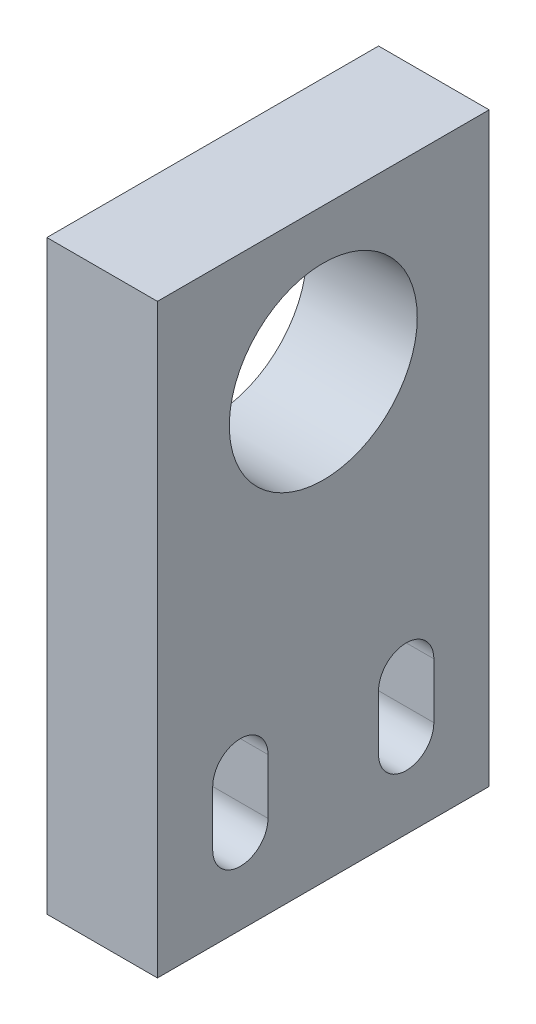
ISO-10303-21;
HEADER;
FILE_DESCRIPTION(('STEP AP214'),'2;1');
FILE_NAME('part.step','',(''),(''),'','','');
FILE_SCHEMA(('AUTOMOTIVE_DESIGN { 1 0 10303 214 1 1 1 1 }'));
ENDSEC;
DATA;
#1=APPLICATION_CONTEXT('core data for automotive mechanical design processes');
#2=APPLICATION_PROTOCOL_DEFINITION('international standard','automotive_design',2000,#1);
#3=PRODUCT_CONTEXT('',#1,'mechanical');
#4=PRODUCT('Part','Part','',(#3));
#5=PRODUCT_RELATED_PRODUCT_CATEGORY('part','',(#4));
#6=PRODUCT_DEFINITION_FORMATION('','',#4);
#7=PRODUCT_DEFINITION_CONTEXT('part definition',#1,'design');
#8=PRODUCT_DEFINITION('design','',#6,#7);
#9=PRODUCT_DEFINITION_SHAPE('','',#8);
#10=(LENGTH_UNIT() NAMED_UNIT(*) SI_UNIT(.MILLI.,.METRE.));
#11=(NAMED_UNIT(*) PLANE_ANGLE_UNIT() SI_UNIT($,.RADIAN.));
#12=(NAMED_UNIT(*) SI_UNIT($,.STERADIAN.) SOLID_ANGLE_UNIT());
#13=UNCERTAINTY_MEASURE_WITH_UNIT(LENGTH_MEASURE(1.E-05),#10,'distance_accuracy_value','');
#14=(GEOMETRIC_REPRESENTATION_CONTEXT(3) GLOBAL_UNCERTAINTY_ASSIGNED_CONTEXT((#13)) GLOBAL_UNIT_ASSIGNED_CONTEXT((#10,
#11,#12)) REPRESENTATION_CONTEXT('',''));
#15=CARTESIAN_POINT('',(0.,0.,0.));
#16=DIRECTION('',(0.,0.,1.));
#17=DIRECTION('',(1.,0.,0.));
#18=AXIS2_PLACEMENT_3D('',#15,#16,#17);
#19=CARTESIAN_POINT('',(10.,0.,0.));
#20=DIRECTION('',(-1.,0.,0.));
#21=DIRECTION('',(0.,0.,1.));
#22=AXIS2_PLACEMENT_3D('',#19,#20,#21);
#23=PLANE('',#22);
#24=CARTESIAN_POINT('',(10.,-27.5,7.49999999999999));
#25=DIRECTION('',(1.,0.,0.));
#26=DIRECTION('',(0.,0.,-1.));
#27=AXIS2_PLACEMENT_3D('',#24,#25,#26);
#28=CIRCLE('',#27,2.50000000000001);
#29=CARTESIAN_POINT('',(10.,-27.5,4.99999999999997));
#30=VERTEX_POINT('',#29);
#31=CARTESIAN_POINT('',(10.,-27.5,9.99999999999999));
#32=VERTEX_POINT('',#31);
#33=EDGE_CURVE('E162',#30,#32,#28,.T.);
#34=ORIENTED_EDGE('',*,*,#33,.F.);
#35=DIRECTION('',(0.,1.,0.));
#36=VECTOR('',#35,1.);
#37=CARTESIAN_POINT('',(10.,-27.5,4.99999999999997));
#38=LINE('',#37,#36);
#39=CARTESIAN_POINT('',(10.,-32.5,4.99999999999997));
#40=VERTEX_POINT('',#39);
#41=EDGE_CURVE('E170',#40,#30,#38,.T.);
#42=ORIENTED_EDGE('',*,*,#41,.F.);
#43=CARTESIAN_POINT('',(10.,-32.5,7.49999999999999));
#44=DIRECTION('',(1.,0.,0.));
#45=DIRECTION('',(0.,0.,-1.));
#46=AXIS2_PLACEMENT_3D('',#43,#44,#45);
#47=CIRCLE('',#46,2.50000000000001);
#48=CARTESIAN_POINT('',(10.,-32.5,10.));
#49=VERTEX_POINT('',#48);
#50=EDGE_CURVE('E167',#49,#40,#47,.T.);
#51=ORIENTED_EDGE('',*,*,#50,.F.);
#52=DIRECTION('',(0.,-1.,0.));
#53=VECTOR('',#52,1.);
#54=CARTESIAN_POINT('',(10.,-27.5,9.99999999999999));
#55=LINE('',#54,#53);
#56=EDGE_CURVE('E164',#32,#49,#55,.T.);
#57=ORIENTED_EDGE('',*,*,#56,.F.);
#58=EDGE_LOOP('',(#34,#42,#51,#57));
#59=FACE_BOUND('',#58,.T.);
#60=DIRECTION('',(0.,-1.,0.));
#61=VECTOR('',#60,1.);
#62=CARTESIAN_POINT('',(10.,-40.,15.));
#63=LINE('',#62,#61);
#64=CARTESIAN_POINT('',(10.,13.,15.));
#65=VERTEX_POINT('',#64);
#66=CARTESIAN_POINT('',(10.,-40.,15.));
#67=VERTEX_POINT('',#66);
#68=EDGE_CURVE('E199',#65,#67,#63,.T.);
#69=ORIENTED_EDGE('',*,*,#68,.T.);
#70=DIRECTION('',(0.,0.,-1.));
#71=VECTOR('',#70,1.);
#72=CARTESIAN_POINT('',(10.,-40.,-15.));
#73=LINE('',#72,#71);
#74=CARTESIAN_POINT('',(10.,-40.,-15.));
#75=VERTEX_POINT('',#74);
#76=EDGE_CURVE('E202',#67,#75,#73,.T.);
#77=ORIENTED_EDGE('',*,*,#76,.T.);
#78=DIRECTION('',(0.,1.,0.));
#79=VECTOR('',#78,1.);
#80=CARTESIAN_POINT('',(10.,13.,-15.));
#81=LINE('',#80,#79);
#82=CARTESIAN_POINT('',(10.,13.,-15.));
#83=VERTEX_POINT('',#82);
#84=EDGE_CURVE('E205',#75,#83,#81,.T.);
#85=ORIENTED_EDGE('',*,*,#84,.T.);
#86=DIRECTION('',(0.,0.,1.));
#87=VECTOR('',#86,1.);
#88=CARTESIAN_POINT('',(10.,13.,15.));
#89=LINE('',#88,#87);
#90=EDGE_CURVE('E207',#83,#65,#89,.T.);
#91=ORIENTED_EDGE('',*,*,#90,.T.);
#92=EDGE_LOOP('',(#69,#77,#85,#91));
#93=FACE_BOUND('',#92,.T.);
#94=CARTESIAN_POINT('',(10.,0.,0.));
#95=DIRECTION('',(1.,0.,0.));
#96=DIRECTION('',(0.,0.,-1.));
#97=AXIS2_PLACEMENT_3D('',#94,#95,#96);
#98=CIRCLE('',#97,8.5);
#99=CARTESIAN_POINT('',(10.,0.,-8.5));
#100=VERTEX_POINT('',#99);
#101=EDGE_CURVE('E193',#100,#100,#98,.T.);
#102=ORIENTED_EDGE('',*,*,#101,.F.);
#103=EDGE_LOOP('',(#102));
#104=FACE_BOUND('',#103,.T.);
#105=CARTESIAN_POINT('',(10.,-27.5,-7.49999999999999));
#106=DIRECTION('',(1.,0.,0.));
#107=DIRECTION('',(0.,0.,1.));
#108=AXIS2_PLACEMENT_3D('',#105,#106,#107);
#109=CIRCLE('',#108,2.50000000000001);
#110=CARTESIAN_POINT('',(10.,-27.5,-10.));
#111=VERTEX_POINT('',#110);
#112=CARTESIAN_POINT('',(10.,-27.5,-4.99999999999998));
#113=VERTEX_POINT('',#112);
#114=EDGE_CURVE('E126',#111,#113,#109,.T.);
#115=ORIENTED_EDGE('',*,*,#114,.F.);
#116=DIRECTION('',(0.,1.,0.));
#117=VECTOR('',#116,1.);
#118=CARTESIAN_POINT('',(10.,-27.5,-10.));
#119=LINE('',#118,#117);
#120=CARTESIAN_POINT('',(10.,-32.5,-10.));
#121=VERTEX_POINT('',#120);
#122=EDGE_CURVE('E148',#121,#111,#119,.T.);
#123=ORIENTED_EDGE('',*,*,#122,.F.);
#124=CARTESIAN_POINT('',(10.,-32.5,-7.49999999999999));
#125=DIRECTION('',(1.,0.,0.));
#126=DIRECTION('',(0.,0.,1.));
#127=AXIS2_PLACEMENT_3D('',#124,#125,#126);
#128=CIRCLE('',#127,2.50000000000001);
#129=CARTESIAN_POINT('',(10.,-32.5,-4.99999999999998));
#130=VERTEX_POINT('',#129);
#131=EDGE_CURVE('E146',#130,#121,#128,.T.);
#132=ORIENTED_EDGE('',*,*,#131,.F.);
#133=DIRECTION('',(0.,-1.,0.));
#134=VECTOR('',#133,1.);
#135=CARTESIAN_POINT('',(10.,-27.5,-4.99999999999998));
#136=LINE('',#135,#134);
#137=EDGE_CURVE('E134',#113,#130,#136,.T.);
#138=ORIENTED_EDGE('',*,*,#137,.F.);
#139=EDGE_LOOP('',(#115,#123,#132,#138));
#140=FACE_BOUND('',#139,.T.);
#141=ADVANCED_FACE('F37',(#59,#93,#104,#140),#23,.F.);
#142=CARTESIAN_POINT('',(0.,0.,0.));
#143=DIRECTION('',(-1.,0.,0.));
#144=DIRECTION('',(0.,0.,1.));
#145=AXIS2_PLACEMENT_3D('',#142,#143,#144);
#146=PLANE('',#145);
#147=DIRECTION('',(0.,-1.,0.));
#148=VECTOR('',#147,1.);
#149=CARTESIAN_POINT('',(0.,-40.,15.));
#150=LINE('',#149,#148);
#151=CARTESIAN_POINT('',(0.,13.,15.));
#152=VERTEX_POINT('',#151);
#153=CARTESIAN_POINT('',(0.,-40.,15.));
#154=VERTEX_POINT('',#153);
#155=EDGE_CURVE('E196',#152,#154,#150,.T.);
#156=ORIENTED_EDGE('',*,*,#155,.F.);
#157=DIRECTION('',(0.,0.,1.));
#158=VECTOR('',#157,1.);
#159=CARTESIAN_POINT('',(0.,13.,15.));
#160=LINE('',#159,#158);
#161=CARTESIAN_POINT('',(0.,13.,-15.));
#162=VERTEX_POINT('',#161);
#163=EDGE_CURVE('E203',#162,#152,#160,.T.);
#164=ORIENTED_EDGE('',*,*,#163,.F.);
#165=DIRECTION('',(0.,1.,0.));
#166=VECTOR('',#165,1.);
#167=CARTESIAN_POINT('',(0.,13.,-15.));
#168=LINE('',#167,#166);
#169=CARTESIAN_POINT('',(0.,-40.,-15.));
#170=VERTEX_POINT('',#169);
#171=EDGE_CURVE('E214',#170,#162,#168,.T.);
#172=ORIENTED_EDGE('',*,*,#171,.F.);
#173=DIRECTION('',(0.,0.,-1.));
#174=VECTOR('',#173,1.);
#175=CARTESIAN_POINT('',(0.,-40.,-15.));
#176=LINE('',#175,#174);
#177=EDGE_CURVE('E212',#154,#170,#176,.T.);
#178=ORIENTED_EDGE('',*,*,#177,.F.);
#179=EDGE_LOOP('',(#156,#164,#172,#178));
#180=FACE_BOUND('',#179,.T.);
#181=CARTESIAN_POINT('',(0.,0.,0.));
#182=DIRECTION('',(1.,0.,0.));
#183=DIRECTION('',(0.,0.,-1.));
#184=AXIS2_PLACEMENT_3D('',#181,#182,#183);
#185=CIRCLE('',#184,8.5);
#186=CARTESIAN_POINT('',(0.,0.,-8.5));
#187=VERTEX_POINT('',#186);
#188=EDGE_CURVE('E192',#187,#187,#185,.T.);
#189=ORIENTED_EDGE('',*,*,#188,.T.);
#190=EDGE_LOOP('',(#189));
#191=FACE_BOUND('',#190,.T.);
#192=DIRECTION('',(0.,1.,0.));
#193=VECTOR('',#192,1.);
#194=CARTESIAN_POINT('',(0.,-27.5,4.99999999999997));
#195=LINE('',#194,#193);
#196=CARTESIAN_POINT('',(0.,-32.5,4.99999999999997));
#197=VERTEX_POINT('',#196);
#198=CARTESIAN_POINT('',(0.,-27.5,4.99999999999997));
#199=VERTEX_POINT('',#198);
#200=EDGE_CURVE('E165',#197,#199,#195,.T.);
#201=ORIENTED_EDGE('',*,*,#200,.T.);
#202=CARTESIAN_POINT('',(0.,-27.5,7.49999999999999));
#203=DIRECTION('',(1.,0.,0.));
#204=DIRECTION('',(0.,0.,-1.));
#205=AXIS2_PLACEMENT_3D('',#202,#203,#204);
#206=CIRCLE('',#205,2.50000000000001);
#207=CARTESIAN_POINT('',(0.,-27.5,9.99999999999999));
#208=VERTEX_POINT('',#207);
#209=EDGE_CURVE('E142',#199,#208,#206,.T.);
#210=ORIENTED_EDGE('',*,*,#209,.T.);
#211=DIRECTION('',(0.,-1.,0.));
#212=VECTOR('',#211,1.);
#213=CARTESIAN_POINT('',(0.,-27.5,9.99999999999999));
#214=LINE('',#213,#212);
#215=CARTESIAN_POINT('',(0.,-32.5,10.));
#216=VERTEX_POINT('',#215);
#217=EDGE_CURVE('E175',#208,#216,#214,.T.);
#218=ORIENTED_EDGE('',*,*,#217,.T.);
#219=CARTESIAN_POINT('',(0.,-32.5,7.49999999999999));
#220=DIRECTION('',(1.,0.,0.));
#221=DIRECTION('',(0.,0.,-1.));
#222=AXIS2_PLACEMENT_3D('',#219,#220,#221);
#223=CIRCLE('',#222,2.50000000000001);
#224=EDGE_CURVE('E178',#216,#197,#223,.T.);
#225=ORIENTED_EDGE('',*,*,#224,.T.);
#226=EDGE_LOOP('',(#201,#210,#218,#225));
#227=FACE_BOUND('',#226,.T.);
#228=DIRECTION('',(0.,1.,0.));
#229=VECTOR('',#228,1.);
#230=CARTESIAN_POINT('',(0.,-27.5,-10.));
#231=LINE('',#230,#229);
#232=CARTESIAN_POINT('',(0.,-32.5,-10.));
#233=VERTEX_POINT('',#232);
#234=CARTESIAN_POINT('',(0.,-27.5,-10.));
#235=VERTEX_POINT('',#234);
#236=EDGE_CURVE('E135',#233,#235,#231,.T.);
#237=ORIENTED_EDGE('',*,*,#236,.T.);
#238=CARTESIAN_POINT('',(0.,-27.5,-7.49999999999999));
#239=DIRECTION('',(1.,0.,0.));
#240=DIRECTION('',(0.,0.,1.));
#241=AXIS2_PLACEMENT_3D('',#238,#239,#240);
#242=CIRCLE('',#241,2.50000000000001);
#243=CARTESIAN_POINT('',(0.,-27.5,-4.99999999999998));
#244=VERTEX_POINT('',#243);
#245=EDGE_CURVE('E60',#235,#244,#242,.T.);
#246=ORIENTED_EDGE('',*,*,#245,.T.);
#247=DIRECTION('',(0.,-1.,0.));
#248=VECTOR('',#247,1.);
#249=CARTESIAN_POINT('',(0.,-27.5,-4.99999999999998));
#250=LINE('',#249,#248);
#251=CARTESIAN_POINT('',(0.,-32.5,-4.99999999999998));
#252=VERTEX_POINT('',#251);
#253=EDGE_CURVE('E141',#244,#252,#250,.T.);
#254=ORIENTED_EDGE('',*,*,#253,.T.);
#255=CARTESIAN_POINT('',(0.,-32.5,-7.49999999999999));
#256=DIRECTION('',(1.,0.,0.));
#257=DIRECTION('',(0.,0.,1.));
#258=AXIS2_PLACEMENT_3D('',#255,#256,#257);
#259=CIRCLE('',#258,2.50000000000001);
#260=EDGE_CURVE('E154',#252,#233,#259,.T.);
#261=ORIENTED_EDGE('',*,*,#260,.T.);
#262=EDGE_LOOP('',(#237,#246,#254,#261));
#263=FACE_BOUND('',#262,.T.);
#264=ADVANCED_FACE('F232',(#180,#191,#227,#263),#146,.T.);
#265=CARTESIAN_POINT('',(10.,-40.,15.));
#266=DIRECTION('',(0.,0.,-1.));
#267=DIRECTION('',(-1.,0.,0.));
#268=AXIS2_PLACEMENT_3D('',#265,#266,#267);
#269=PLANE('',#268);
#270=ORIENTED_EDGE('',*,*,#155,.T.);
#271=DIRECTION('',(-1.,0.,0.));
#272=VECTOR('',#271,1.);
#273=CARTESIAN_POINT('',(10.,-40.,15.));
#274=LINE('',#273,#272);
#275=EDGE_CURVE('E11',#67,#154,#274,.T.);
#276=ORIENTED_EDGE('',*,*,#275,.F.);
#277=ORIENTED_EDGE('',*,*,#68,.F.);
#278=DIRECTION('',(-1.,0.,0.));
#279=VECTOR('',#278,1.);
#280=CARTESIAN_POINT('',(10.,13.,15.));
#281=LINE('',#280,#279);
#282=EDGE_CURVE('E209',#65,#152,#281,.T.);
#283=ORIENTED_EDGE('',*,*,#282,.T.);
#284=EDGE_LOOP('',(#270,#276,#277,#283));
#285=FACE_BOUND('',#284,.T.);
#286=ADVANCED_FACE('F39',(#285),#269,.F.);
#287=CARTESIAN_POINT('',(10.,-40.,-15.));
#288=DIRECTION('',(0.,1.,0.));
#289=DIRECTION('',(0.,0.,1.));
#290=AXIS2_PLACEMENT_3D('',#287,#288,#289);
#291=PLANE('',#290);
#292=ORIENTED_EDGE('',*,*,#177,.T.);
#293=DIRECTION('',(-1.,0.,0.));
#294=VECTOR('',#293,1.);
#295=CARTESIAN_POINT('',(10.,-40.,-15.));
#296=LINE('',#295,#294);
#297=EDGE_CURVE('E45',#75,#170,#296,.T.);
#298=ORIENTED_EDGE('',*,*,#297,.F.);
#299=ORIENTED_EDGE('',*,*,#76,.F.);
#300=ORIENTED_EDGE('',*,*,#275,.T.);
#301=EDGE_LOOP('',(#292,#298,#299,#300));
#302=FACE_BOUND('',#301,.T.);
#303=ADVANCED_FACE('F243',(#302),#291,.F.);
#304=CARTESIAN_POINT('',(10.,13.,-15.));
#305=DIRECTION('',(0.,0.,1.));
#306=DIRECTION('',(0.,-1.,0.));
#307=AXIS2_PLACEMENT_3D('',#304,#305,#306);
#308=PLANE('',#307);
#309=ORIENTED_EDGE('',*,*,#171,.T.);
#310=DIRECTION('',(-1.,0.,0.));
#311=VECTOR('',#310,1.);
#312=CARTESIAN_POINT('',(10.,13.,-15.));
#313=LINE('',#312,#311);
#314=EDGE_CURVE('E219',#83,#162,#313,.T.);
#315=ORIENTED_EDGE('',*,*,#314,.F.);
#316=ORIENTED_EDGE('',*,*,#84,.F.);
#317=ORIENTED_EDGE('',*,*,#297,.T.);
#318=EDGE_LOOP('',(#309,#315,#316,#317));
#319=FACE_BOUND('',#318,.T.);
#320=ADVANCED_FACE('F226',(#319),#308,.F.);
#321=CARTESIAN_POINT('',(10.,13.,15.));
#322=DIRECTION('',(0.,-1.,0.));
#323=DIRECTION('',(0.,0.,-1.));
#324=AXIS2_PLACEMENT_3D('',#321,#322,#323);
#325=PLANE('',#324);
#326=ORIENTED_EDGE('',*,*,#163,.T.);
#327=ORIENTED_EDGE('',*,*,#282,.F.);
#328=ORIENTED_EDGE('',*,*,#90,.F.);
#329=ORIENTED_EDGE('',*,*,#314,.T.);
#330=EDGE_LOOP('',(#326,#327,#328,#329));
#331=FACE_BOUND('',#330,.T.);
#332=ADVANCED_FACE('F236',(#331),#325,.F.);
#333=CARTESIAN_POINT('',(10.,0.,0.));
#334=DIRECTION('',(-1.,0.,0.));
#335=DIRECTION('',(0.,0.,1.));
#336=AXIS2_PLACEMENT_3D('',#333,#334,#335);
#337=CYLINDRICAL_SURFACE('',#336,8.5);
#338=ORIENTED_EDGE('',*,*,#101,.T.);
#339=EDGE_LOOP('',(#338));
#340=FACE_BOUND('',#339,.T.);
#341=ORIENTED_EDGE('',*,*,#188,.F.);
#342=EDGE_LOOP('',(#341));
#343=FACE_BOUND('',#342,.T.);
#344=ADVANCED_FACE('F259',(#340,#343),#337,.F.);
#345=CARTESIAN_POINT('',(10.,-27.5,7.49999999999999));
#346=DIRECTION('',(-1.,0.,0.));
#347=DIRECTION('',(0.,0.,1.));
#348=AXIS2_PLACEMENT_3D('',#345,#346,#347);
#349=CYLINDRICAL_SURFACE('',#348,2.50000000000001);
#350=ORIENTED_EDGE('',*,*,#209,.F.);
#351=DIRECTION('',(-1.,0.,0.));
#352=VECTOR('',#351,1.);
#353=CARTESIAN_POINT('',(10.,-27.5,4.99999999999997));
#354=LINE('',#353,#352);
#355=EDGE_CURVE('E172',#30,#199,#354,.T.);
#356=ORIENTED_EDGE('',*,*,#355,.F.);
#357=ORIENTED_EDGE('',*,*,#33,.T.);
#358=DIRECTION('',(-1.,0.,0.));
#359=VECTOR('',#358,1.);
#360=CARTESIAN_POINT('',(10.,-27.5,9.99999999999999));
#361=LINE('',#360,#359);
#362=EDGE_CURVE('E189',#32,#208,#361,.T.);
#363=ORIENTED_EDGE('',*,*,#362,.T.);
#364=EDGE_LOOP('',(#350,#356,#357,#363));
#365=FACE_BOUND('',#364,.T.);
#366=ADVANCED_FACE('F266',(#365),#349,.F.);
#367=CARTESIAN_POINT('',(10.,-27.5,9.99999999999999));
#368=DIRECTION('',(0.,0.,-1.));
#369=DIRECTION('',(-1.,0.,0.));
#370=AXIS2_PLACEMENT_3D('',#367,#368,#369);
#371=PLANE('',#370);
#372=ORIENTED_EDGE('',*,*,#217,.F.);
#373=ORIENTED_EDGE('',*,*,#362,.F.);
#374=ORIENTED_EDGE('',*,*,#56,.T.);
#375=DIRECTION('',(-1.,0.,0.));
#376=VECTOR('',#375,1.);
#377=CARTESIAN_POINT('',(10.,-32.5,10.));
#378=LINE('',#377,#376);
#379=EDGE_CURVE('E187',#49,#216,#378,.T.);
#380=ORIENTED_EDGE('',*,*,#379,.T.);
#381=EDGE_LOOP('',(#372,#373,#374,#380));
#382=FACE_BOUND('',#381,.T.);
#383=ADVANCED_FACE('F271',(#382),#371,.T.);
#384=CARTESIAN_POINT('',(10.,-32.5,7.49999999999999));
#385=DIRECTION('',(-1.,0.,0.));
#386=DIRECTION('',(0.,0.,1.));
#387=AXIS2_PLACEMENT_3D('',#384,#385,#386);
#388=CYLINDRICAL_SURFACE('',#387,2.50000000000001);
#389=ORIENTED_EDGE('',*,*,#224,.F.);
#390=ORIENTED_EDGE('',*,*,#379,.F.);
#391=ORIENTED_EDGE('',*,*,#50,.T.);
#392=DIRECTION('',(-1.,0.,0.));
#393=VECTOR('',#392,1.);
#394=CARTESIAN_POINT('',(10.,-32.5,4.99999999999997));
#395=LINE('',#394,#393);
#396=EDGE_CURVE('E185',#40,#197,#395,.T.);
#397=ORIENTED_EDGE('',*,*,#396,.T.);
#398=EDGE_LOOP('',(#389,#390,#391,#397));
#399=FACE_BOUND('',#398,.T.);
#400=ADVANCED_FACE('F297',(#399),#388,.F.);
#401=CARTESIAN_POINT('',(10.,-27.5,4.99999999999997));
#402=DIRECTION('',(0.,0.,1.));
#403=DIRECTION('',(1.,0.,0.));
#404=AXIS2_PLACEMENT_3D('',#401,#402,#403);
#405=PLANE('',#404);
#406=ORIENTED_EDGE('',*,*,#200,.F.);
#407=ORIENTED_EDGE('',*,*,#396,.F.);
#408=ORIENTED_EDGE('',*,*,#41,.T.);
#409=ORIENTED_EDGE('',*,*,#355,.T.);
#410=EDGE_LOOP('',(#406,#407,#408,#409));
#411=FACE_BOUND('',#410,.T.);
#412=ADVANCED_FACE('F294',(#411),#405,.T.);
#413=CARTESIAN_POINT('',(10.,-27.5,-7.49999999999999));
#414=DIRECTION('',(-1.,0.,0.));
#415=DIRECTION('',(0.,0.,1.));
#416=AXIS2_PLACEMENT_3D('',#413,#414,#415);
#417=CYLINDRICAL_SURFACE('',#416,2.50000000000001);
#418=ORIENTED_EDGE('',*,*,#245,.F.);
#419=DIRECTION('',(-1.,0.,0.));
#420=VECTOR('',#419,1.);
#421=CARTESIAN_POINT('',(10.,-27.5,-10.));
#422=LINE('',#421,#420);
#423=EDGE_CURVE('E130',#111,#235,#422,.T.);
#424=ORIENTED_EDGE('',*,*,#423,.F.);
#425=ORIENTED_EDGE('',*,*,#114,.T.);
#426=DIRECTION('',(-1.,0.,0.));
#427=VECTOR('',#426,1.);
#428=CARTESIAN_POINT('',(10.,-27.5,-4.99999999999998));
#429=LINE('',#428,#427);
#430=EDGE_CURVE('E129',#113,#244,#429,.T.);
#431=ORIENTED_EDGE('',*,*,#430,.T.);
#432=EDGE_LOOP('',(#418,#424,#425,#431));
#433=FACE_BOUND('',#432,.T.);
#434=ADVANCED_FACE('F128',(#433),#417,.F.);
#435=CARTESIAN_POINT('',(10.,-27.5,-4.99999999999998));
#436=DIRECTION('',(0.,0.,-1.));
#437=DIRECTION('',(-1.,0.,0.));
#438=AXIS2_PLACEMENT_3D('',#435,#436,#437);
#439=PLANE('',#438);
#440=ORIENTED_EDGE('',*,*,#253,.F.);
#441=ORIENTED_EDGE('',*,*,#430,.F.);
#442=ORIENTED_EDGE('',*,*,#137,.T.);
#443=DIRECTION('',(-1.,0.,0.));
#444=VECTOR('',#443,1.);
#445=CARTESIAN_POINT('',(10.,-32.5,-4.99999999999998));
#446=LINE('',#445,#444);
#447=EDGE_CURVE('E143',#130,#252,#446,.T.);
#448=ORIENTED_EDGE('',*,*,#447,.T.);
#449=EDGE_LOOP('',(#440,#441,#442,#448));
#450=FACE_BOUND('',#449,.T.);
#451=ADVANCED_FACE('F138',(#450),#439,.T.);
#452=CARTESIAN_POINT('',(10.,-32.5,-7.49999999999999));
#453=DIRECTION('',(-1.,0.,0.));
#454=DIRECTION('',(0.,0.,1.));
#455=AXIS2_PLACEMENT_3D('',#452,#453,#454);
#456=CYLINDRICAL_SURFACE('',#455,2.50000000000001);
#457=ORIENTED_EDGE('',*,*,#260,.F.);
#458=ORIENTED_EDGE('',*,*,#447,.F.);
#459=ORIENTED_EDGE('',*,*,#131,.T.);
#460=DIRECTION('',(-1.,0.,0.));
#461=VECTOR('',#460,1.);
#462=CARTESIAN_POINT('',(10.,-32.5,-10.));
#463=LINE('',#462,#461);
#464=EDGE_CURVE('E52',#121,#233,#463,.T.);
#465=ORIENTED_EDGE('',*,*,#464,.T.);
#466=EDGE_LOOP('',(#457,#458,#459,#465));
#467=FACE_BOUND('',#466,.T.);
#468=ADVANCED_FACE('F282',(#467),#456,.F.);
#469=CARTESIAN_POINT('',(10.,-27.5,-10.));
#470=DIRECTION('',(0.,0.,1.));
#471=DIRECTION('',(1.,0.,0.));
#472=AXIS2_PLACEMENT_3D('',#469,#470,#471);
#473=PLANE('',#472);
#474=ORIENTED_EDGE('',*,*,#236,.F.);
#475=ORIENTED_EDGE('',*,*,#464,.F.);
#476=ORIENTED_EDGE('',*,*,#122,.T.);
#477=ORIENTED_EDGE('',*,*,#423,.T.);
#478=EDGE_LOOP('',(#474,#475,#476,#477));
#479=FACE_BOUND('',#478,.T.);
#480=ADVANCED_FACE('F280',(#479),#473,.T.);
#481=CLOSED_SHELL('',(#141,#264,#286,#303,#320,#332,#344,#366,#383,#400,#412,#434,#451,#468,#480));
#482=MANIFOLD_SOLID_BREP('B2',#481);
#483=ADVANCED_BREP_SHAPE_REPRESENTATION('',(#18,#482),#14);
#484=SHAPE_DEFINITION_REPRESENTATION(#9,#483);
ENDSEC;
END-ISO-10303-21;
